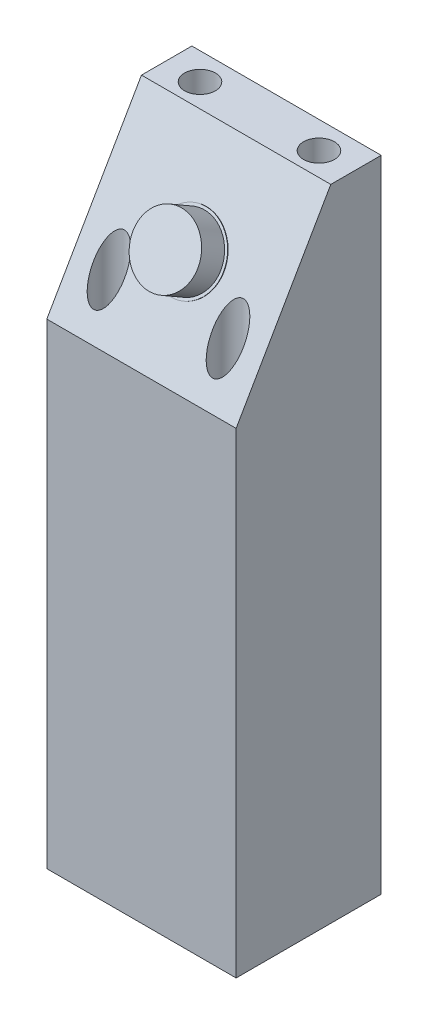
ISO-10303-21;
HEADER;
FILE_DESCRIPTION(('STEP AP214'),'2;1');
FILE_NAME('part.step','',(''),(''),'','','');
FILE_SCHEMA(('AUTOMOTIVE_DESIGN { 1 0 10303 214 1 1 1 1 }'));
ENDSEC;
DATA;
#1=APPLICATION_CONTEXT('core data for automotive mechanical design processes');
#2=APPLICATION_PROTOCOL_DEFINITION('international standard','automotive_design',2000,#1);
#3=PRODUCT_CONTEXT('',#1,'mechanical');
#4=PRODUCT('Part','Part','',(#3));
#5=PRODUCT_RELATED_PRODUCT_CATEGORY('part','',(#4));
#6=PRODUCT_DEFINITION_FORMATION('','',#4);
#7=PRODUCT_DEFINITION_CONTEXT('part definition',#1,'design');
#8=PRODUCT_DEFINITION('design','',#6,#7);
#9=PRODUCT_DEFINITION_SHAPE('','',#8);
#10=(LENGTH_UNIT() NAMED_UNIT(*) SI_UNIT(.MILLI.,.METRE.));
#11=(NAMED_UNIT(*) PLANE_ANGLE_UNIT() SI_UNIT($,.RADIAN.));
#12=(NAMED_UNIT(*) SI_UNIT($,.STERADIAN.) SOLID_ANGLE_UNIT());
#13=UNCERTAINTY_MEASURE_WITH_UNIT(LENGTH_MEASURE(1.E-05),#10,'distance_accuracy_value','');
#14=(GEOMETRIC_REPRESENTATION_CONTEXT(3) GLOBAL_UNCERTAINTY_ASSIGNED_CONTEXT((#13)) GLOBAL_UNIT_ASSIGNED_CONTEXT((#10,
#11,#12)) REPRESENTATION_CONTEXT('',''));
#15=CARTESIAN_POINT('',(0.,0.,0.));
#16=DIRECTION('',(0.,0.,1.));
#17=DIRECTION('',(1.,0.,0.));
#18=AXIS2_PLACEMENT_3D('',#15,#16,#17);
#19=CARTESIAN_POINT('',(28.5,4.5,-5.));
#20=DIRECTION('',(0.,-1.,0.));
#21=DIRECTION('',(0.,0.,-1.));
#22=AXIS2_PLACEMENT_3D('',#19,#20,#21);
#23=PLANE('',#22);
#24=CARTESIAN_POINT('',(28.5,4.5,-5.));
#25=DIRECTION('',(0.,-1.,0.));
#26=DIRECTION('',(0.,0.,-1.));
#27=AXIS2_PLACEMENT_3D('',#24,#25,#26);
#28=CIRCLE('',#27,2.85);
#29=CARTESIAN_POINT('',(28.5,4.5,-7.85));
#30=VERTEX_POINT('',#29);
#31=EDGE_CURVE('E133',#30,#30,#28,.T.);
#32=ORIENTED_EDGE('',*,*,#31,.F.);
#33=EDGE_LOOP('',(#32));
#34=FACE_BOUND('',#33,.T.);
#35=CARTESIAN_POINT('',(28.5,4.5,-5.));
#36=DIRECTION('',(0.,1.,0.));
#37=DIRECTION('',(0.,0.,1.));
#38=AXIS2_PLACEMENT_3D('',#35,#36,#37);
#39=CIRCLE('',#38,1.7);
#40=CARTESIAN_POINT('',(28.5,4.5,-3.3));
#41=VERTEX_POINT('',#40);
#42=EDGE_CURVE('E234',#41,#41,#39,.T.);
#43=ORIENTED_EDGE('',*,*,#42,.F.);
#44=EDGE_LOOP('',(#43));
#45=FACE_BOUND('',#44,.T.);
#46=ADVANCED_FACE('F35',(#34,#45),#23,.F.);
#47=CARTESIAN_POINT('',(35.,0.,0.));
#48=DIRECTION('',(0.,0.,-1.));
#49=DIRECTION('',(-1.,0.,0.));
#50=AXIS2_PLACEMENT_3D('',#47,#48,#49);
#51=PLANE('',#50);
#52=DIRECTION('',(0.,-1.,0.));
#53=VECTOR('',#52,1.);
#54=CARTESIAN_POINT('',(0.,0.,0.));
#55=LINE('',#54,#53);
#56=CARTESIAN_POINT('',(0.,88.,0.));
#57=VERTEX_POINT('',#56);
#58=CARTESIAN_POINT('',(0.,0.,0.));
#59=VERTEX_POINT('',#58);
#60=EDGE_CURVE('E114',#57,#59,#55,.T.);
#61=ORIENTED_EDGE('',*,*,#60,.T.);
#62=DIRECTION('',(-1.,0.,0.));
#63=VECTOR('',#62,1.);
#64=CARTESIAN_POINT('',(35.,0.,0.));
#65=LINE('',#64,#63);
#66=CARTESIAN_POINT('',(35.,0.,0.));
#67=VERTEX_POINT('',#66);
#68=EDGE_CURVE('E45',#67,#59,#65,.T.);
#69=ORIENTED_EDGE('',*,*,#68,.F.);
#70=DIRECTION('',(0.,-1.,0.));
#71=VECTOR('',#70,1.);
#72=CARTESIAN_POINT('',(35.,0.,0.));
#73=LINE('',#72,#71);
#74=CARTESIAN_POINT('',(35.,88.,0.));
#75=VERTEX_POINT('',#74);
#76=EDGE_CURVE('E123',#75,#67,#73,.T.);
#77=ORIENTED_EDGE('',*,*,#76,.F.);
#78=DIRECTION('',(-1.,0.,0.));
#79=VECTOR('',#78,1.);
#80=CARTESIAN_POINT('',(35.,88.,0.));
#81=LINE('',#80,#79);
#82=EDGE_CURVE('E110',#75,#57,#81,.T.);
#83=ORIENTED_EDGE('',*,*,#82,.T.);
#84=EDGE_LOOP('',(#61,#69,#77,#83));
#85=FACE_BOUND('',#84,.T.);
#86=ADVANCED_FACE('F37',(#85),#51,.F.);
#87=CARTESIAN_POINT('',(35.,0.,-17.4999999999999));
#88=DIRECTION('',(0.,1.,0.));
#89=DIRECTION('',(0.,0.,1.));
#90=AXIS2_PLACEMENT_3D('',#87,#88,#89);
#91=PLANE('',#90);
#92=CARTESIAN_POINT('',(6.49999999999999,0.,-5.));
#93=DIRECTION('',(0.,1.,0.));
#94=DIRECTION('',(0.,0.,1.));
#95=AXIS2_PLACEMENT_3D('',#92,#93,#94);
#96=CIRCLE('',#95,1.69999999999999);
#97=CARTESIAN_POINT('',(6.49999999999999,0.,-3.30000000000001));
#98=VERTEX_POINT('',#97);
#99=EDGE_CURVE('E221',#98,#98,#96,.T.);
#100=ORIENTED_EDGE('',*,*,#99,.T.);
#101=EDGE_LOOP('',(#100));
#102=FACE_BOUND('',#101,.T.);
#103=CARTESIAN_POINT('',(6.49999999999999,0.,-21.82));
#104=DIRECTION('',(0.,1.,0.));
#105=DIRECTION('',(0.,0.,1.));
#106=AXIS2_PLACEMENT_3D('',#103,#104,#105);
#107=CIRCLE('',#106,1.69999999999999);
#108=CARTESIAN_POINT('',(6.49999999999999,0.,-20.12));
#109=VERTEX_POINT('',#108);
#110=EDGE_CURVE('E225',#109,#109,#107,.T.);
#111=ORIENTED_EDGE('',*,*,#110,.T.);
#112=EDGE_LOOP('',(#111));
#113=FACE_BOUND('',#112,.T.);
#114=CARTESIAN_POINT('',(28.5,0.,-21.82));
#115=DIRECTION('',(0.,1.,0.));
#116=DIRECTION('',(0.,0.,1.));
#117=AXIS2_PLACEMENT_3D('',#114,#115,#116);
#118=CIRCLE('',#117,1.69999999999999);
#119=CARTESIAN_POINT('',(28.5,0.,-20.12));
#120=VERTEX_POINT('',#119);
#121=EDGE_CURVE('E229',#120,#120,#118,.T.);
#122=ORIENTED_EDGE('',*,*,#121,.T.);
#123=EDGE_LOOP('',(#122));
#124=FACE_BOUND('',#123,.T.);
#125=CARTESIAN_POINT('',(28.5,0.,-5.));
#126=DIRECTION('',(0.,1.,0.));
#127=DIRECTION('',(0.,0.,1.));
#128=AXIS2_PLACEMENT_3D('',#125,#126,#127);
#129=CIRCLE('',#128,1.69999999999999);
#130=CARTESIAN_POINT('',(28.5,0.,-3.30000000000001));
#131=VERTEX_POINT('',#130);
#132=EDGE_CURVE('E232',#131,#131,#129,.T.);
#133=ORIENTED_EDGE('',*,*,#132,.T.);
#134=EDGE_LOOP('',(#133));
#135=FACE_BOUND('',#134,.T.);
#136=DIRECTION('',(0.,0.,-1.));
#137=VECTOR('',#136,1.);
#138=CARTESIAN_POINT('',(0.,0.,-17.4999999999999));
#139=LINE('',#138,#137);
#140=CARTESIAN_POINT('',(0.,0.,-26.82));
#141=VERTEX_POINT('',#140);
#142=EDGE_CURVE('E117',#59,#141,#139,.T.);
#143=ORIENTED_EDGE('',*,*,#142,.T.);
#144=DIRECTION('',(-1.,0.,0.));
#145=VECTOR('',#144,1.);
#146=CARTESIAN_POINT('',(35.,0.,-26.82));
#147=LINE('',#146,#145);
#148=CARTESIAN_POINT('',(35.,0.,-26.82));
#149=VERTEX_POINT('',#148);
#150=EDGE_CURVE('E105',#149,#141,#147,.T.);
#151=ORIENTED_EDGE('',*,*,#150,.F.);
#152=DIRECTION('',(0.,0.,-1.));
#153=VECTOR('',#152,1.);
#154=CARTESIAN_POINT('',(35.,0.,0.));
#155=LINE('',#154,#153);
#156=EDGE_CURVE('E89',#67,#149,#155,.T.);
#157=ORIENTED_EDGE('',*,*,#156,.F.);
#158=ORIENTED_EDGE('',*,*,#68,.T.);
#159=EDGE_LOOP('',(#143,#151,#157,#158));
#160=FACE_BOUND('',#159,.T.);
#161=ADVANCED_FACE('F154',(#102,#113,#124,#135,#160),#91,.F.);
#162=CARTESIAN_POINT('',(35.,0.,-26.82));
#163=DIRECTION('',(0.,0.,1.));
#164=DIRECTION('',(1.,0.,0.));
#165=AXIS2_PLACEMENT_3D('',#162,#163,#164);
#166=PLANE('',#165);
#167=DIRECTION('',(0.,1.,0.));
#168=VECTOR('',#167,1.);
#169=CARTESIAN_POINT('',(0.,0.,-26.82));
#170=LINE('',#169,#168);
#171=CARTESIAN_POINT('',(0.,118.310889132455,-26.82));
#172=VERTEX_POINT('',#171);
#173=EDGE_CURVE('E104',#141,#172,#170,.T.);
#174=ORIENTED_EDGE('',*,*,#173,.T.);
#175=DIRECTION('',(-1.,0.,0.));
#176=VECTOR('',#175,1.);
#177=CARTESIAN_POINT('',(35.,118.310889132455,-26.82));
#178=LINE('',#177,#176);
#179=CARTESIAN_POINT('',(35.,118.310889132455,-26.82));
#180=VERTEX_POINT('',#179);
#181=EDGE_CURVE('E101',#180,#172,#178,.T.);
#182=ORIENTED_EDGE('',*,*,#181,.F.);
#183=DIRECTION('',(0.,1.,0.));
#184=VECTOR('',#183,1.);
#185=CARTESIAN_POINT('',(35.,0.,-26.82));
#186=LINE('',#185,#184);
#187=EDGE_CURVE('E93',#149,#180,#186,.T.);
#188=ORIENTED_EDGE('',*,*,#187,.F.);
#189=ORIENTED_EDGE('',*,*,#150,.T.);
#190=EDGE_LOOP('',(#174,#182,#188,#189));
#191=FACE_BOUND('',#190,.T.);
#192=ADVANCED_FACE('F102',(#191),#166,.F.);
#193=CARTESIAN_POINT('',(35.,118.310889132455,-26.82));
#194=DIRECTION('',(0.,-1.,0.));
#195=DIRECTION('',(0.,0.,-1.));
#196=AXIS2_PLACEMENT_3D('',#193,#194,#195);
#197=PLANE('',#196);
#198=CARTESIAN_POINT('',(6.49999999999999,118.310889132455,-21.82));
#199=DIRECTION('',(0.,-1.,0.));
#200=DIRECTION('',(0.,0.,-1.));
#201=AXIS2_PLACEMENT_3D('',#198,#199,#200);
#202=CIRCLE('',#201,2.85);
#203=CARTESIAN_POINT('',(6.49999999999999,118.310889132455,-24.67));
#204=VERTEX_POINT('',#203);
#205=EDGE_CURVE('E244',#204,#204,#202,.T.);
#206=ORIENTED_EDGE('',*,*,#205,.T.);
#207=EDGE_LOOP('',(#206));
#208=FACE_BOUND('',#207,.T.);
#209=CARTESIAN_POINT('',(28.5,118.310889132455,-21.82));
#210=DIRECTION('',(0.,-1.,0.));
#211=DIRECTION('',(0.,0.,1.));
#212=AXIS2_PLACEMENT_3D('',#209,#210,#211);
#213=CIRCLE('',#212,2.85);
#214=CARTESIAN_POINT('',(28.5,118.310889132455,-18.97));
#215=VERTEX_POINT('',#214);
#216=EDGE_CURVE('E237',#215,#215,#213,.T.);
#217=ORIENTED_EDGE('',*,*,#216,.T.);
#218=EDGE_LOOP('',(#217));
#219=FACE_BOUND('',#218,.T.);
#220=DIRECTION('',(0.,0.,1.));
#221=VECTOR('',#220,1.);
#222=CARTESIAN_POINT('',(0.,118.310889132455,-26.82));
#223=LINE('',#222,#221);
#224=CARTESIAN_POINT('',(0.,118.310889132455,-17.4999999999999));
#225=VERTEX_POINT('',#224);
#226=EDGE_CURVE('E74',#172,#225,#223,.T.);
#227=ORIENTED_EDGE('',*,*,#226,.T.);
#228=DIRECTION('',(-1.,0.,0.));
#229=VECTOR('',#228,1.);
#230=CARTESIAN_POINT('',(35.,118.310889132455,-17.4999999999999));
#231=LINE('',#230,#229);
#232=CARTESIAN_POINT('',(35.,118.310889132455,-17.4999999999999));
#233=VERTEX_POINT('',#232);
#234=EDGE_CURVE('E106',#233,#225,#231,.T.);
#235=ORIENTED_EDGE('',*,*,#234,.F.);
#236=DIRECTION('',(0.,0.,1.));
#237=VECTOR('',#236,1.);
#238=CARTESIAN_POINT('',(35.,118.310889132455,-26.82));
#239=LINE('',#238,#237);
#240=EDGE_CURVE('E97',#180,#233,#239,.T.);
#241=ORIENTED_EDGE('',*,*,#240,.F.);
#242=ORIENTED_EDGE('',*,*,#181,.T.);
#243=EDGE_LOOP('',(#227,#235,#241,#242));
#244=FACE_BOUND('',#243,.T.);
#245=ADVANCED_FACE('F108',(#208,#219,#244),#197,.F.);
#246=CARTESIAN_POINT('',(35.,88.,0.));
#247=DIRECTION('',(0.,-0.499999999999998,-0.86602540378444));
#248=DIRECTION('',(0.,0.86602540378444,-0.499999999999998));
#249=AXIS2_PLACEMENT_3D('',#246,#247,#248);
#250=PLANE('',#249);
#251=CARTESIAN_POINT('',(6.49999999999999,96.6602540378445,-5.));
#252=DIRECTION('',(0.,-0.499999999999998,-0.86602540378444));
#253=DIRECTION('',(0.,-0.86602540378444,0.499999999999998));
#254=AXIS2_PLACEMENT_3D('',#251,#252,#253);
#255=ELLIPSE('',#254,5.70000000000003,2.85);
#256=CARTESIAN_POINT('',(6.49999999999999,91.7239092362731,-2.15));
#257=VERTEX_POINT('',#256);
#258=EDGE_CURVE('E39',#257,#257,#255,.T.);
#259=ORIENTED_EDGE('',*,*,#258,.T.);
#260=EDGE_LOOP('',(#259));
#261=FACE_BOUND('',#260,.T.);
#262=CARTESIAN_POINT('',(28.5,96.6602540378445,-5.));
#263=DIRECTION('',(0.,-0.499999999999998,-0.86602540378444));
#264=DIRECTION('',(0.,-0.86602540378444,0.499999999999998));
#265=AXIS2_PLACEMENT_3D('',#262,#263,#264);
#266=ELLIPSE('',#265,5.70000000000003,2.85);
#267=CARTESIAN_POINT('',(28.5,91.7239092362731,-2.15));
#268=VERTEX_POINT('',#267);
#269=EDGE_CURVE('E131',#268,#268,#266,.T.);
#270=ORIENTED_EDGE('',*,*,#269,.T.);
#271=EDGE_LOOP('',(#270));
#272=FACE_BOUND('',#271,.T.);
#273=CARTESIAN_POINT('',(17.5,103.155444566228,-8.74999999999998));
#274=DIRECTION('',(0.,-0.499999999999998,-0.86602540378444));
#275=DIRECTION('',(0.,0.86602540378444,-0.499999999999998));
#276=AXIS2_PLACEMENT_3D('',#273,#274,#275);
#277=CIRCLE('',#276,6.50000000000001);
#278=CARTESIAN_POINT('',(17.5,108.784609690827,-12.));
#279=VERTEX_POINT('',#278);
#280=EDGE_CURVE('E11',#279,#279,#277,.F.);
#281=ORIENTED_EDGE('',*,*,#280,.F.);
#282=EDGE_LOOP('',(#281));
#283=FACE_BOUND('',#282,.T.);
#284=DIRECTION('',(0.,-0.86602540378444,0.499999999999998));
#285=VECTOR('',#284,1.);
#286=CARTESIAN_POINT('',(0.,88.,0.));
#287=LINE('',#286,#285);
#288=EDGE_CURVE('E80',#225,#57,#287,.T.);
#289=ORIENTED_EDGE('',*,*,#288,.T.);
#290=ORIENTED_EDGE('',*,*,#82,.F.);
#291=DIRECTION('',(0.,-0.86602540378444,0.499999999999998));
#292=VECTOR('',#291,1.);
#293=CARTESIAN_POINT('',(35.,88.,0.));
#294=LINE('',#293,#292);
#295=EDGE_CURVE('E54',#233,#75,#294,.T.);
#296=ORIENTED_EDGE('',*,*,#295,.F.);
#297=ORIENTED_EDGE('',*,*,#234,.T.);
#298=EDGE_LOOP('',(#289,#290,#296,#297));
#299=FACE_BOUND('',#298,.T.);
#300=ADVANCED_FACE('F167',(#261,#272,#283,#299),#250,.F.);
#301=CARTESIAN_POINT('',(35.,0.,0.));
#302=DIRECTION('',(1.,0.,0.));
#303=DIRECTION('',(0.,0.,-1.));
#304=AXIS2_PLACEMENT_3D('',#301,#302,#303);
#305=PLANE('',#304);
#306=ORIENTED_EDGE('',*,*,#76,.T.);
#307=ORIENTED_EDGE('',*,*,#156,.T.);
#308=ORIENTED_EDGE('',*,*,#187,.T.);
#309=ORIENTED_EDGE('',*,*,#240,.T.);
#310=ORIENTED_EDGE('',*,*,#295,.T.);
#311=EDGE_LOOP('',(#306,#307,#308,#309,#310));
#312=FACE_BOUND('',#311,.T.);
#313=ADVANCED_FACE('F95',(#312),#305,.T.);
#314=CARTESIAN_POINT('',(0.,0.,0.));
#315=DIRECTION('',(1.,0.,0.));
#316=DIRECTION('',(0.,0.,-1.));
#317=AXIS2_PLACEMENT_3D('',#314,#315,#316);
#318=PLANE('',#317);
#319=ORIENTED_EDGE('',*,*,#60,.F.);
#320=ORIENTED_EDGE('',*,*,#288,.F.);
#321=ORIENTED_EDGE('',*,*,#226,.F.);
#322=ORIENTED_EDGE('',*,*,#173,.F.);
#323=ORIENTED_EDGE('',*,*,#142,.F.);
#324=EDGE_LOOP('',(#319,#320,#321,#322,#323));
#325=FACE_BOUND('',#324,.T.);
#326=ADVANCED_FACE('F156',(#325),#318,.F.);
#327=CARTESIAN_POINT('',(17.5,103.205444566228,-8.66339745962154));
#328=DIRECTION('',(0.,-0.499999999999998,-0.86602540378444));
#329=DIRECTION('',(0.,0.86602540378444,-0.499999999999998));
#330=AXIS2_PLACEMENT_3D('',#327,#328,#329);
#331=CYLINDRICAL_SURFACE('',#330,6.50000000000001);
#332=CARTESIAN_POINT('',(17.5,103.205444566228,-8.66339745962154));
#333=DIRECTION('',(0.,0.499999999999998,0.86602540378444));
#334=DIRECTION('',(0.,-0.86602540378444,0.499999999999998));
#335=AXIS2_PLACEMENT_3D('',#332,#333,#334);
#336=CIRCLE('',#335,6.50000000000001);
#337=CARTESIAN_POINT('',(17.5,97.5762794416289,-5.41339745962155));
#338=VERTEX_POINT('',#337);
#339=EDGE_CURVE('E130',#338,#338,#336,.T.);
#340=ORIENTED_EDGE('',*,*,#339,.F.);
#341=EDGE_LOOP('',(#340));
#342=FACE_BOUND('',#341,.T.);
#343=ORIENTED_EDGE('',*,*,#280,.T.);
#344=EDGE_LOOP('',(#343));
#345=FACE_BOUND('',#344,.T.);
#346=ADVANCED_FACE('F158',(#342,#345),#331,.T.);
#347=CARTESIAN_POINT('',(17.5,103.205444566228,-8.66339745962154));
#348=DIRECTION('',(0.,0.499999999999998,0.86602540378444));
#349=DIRECTION('',(0.,-0.86602540378444,0.499999999999998));
#350=AXIS2_PLACEMENT_3D('',#347,#348,#349);
#351=PLANE('',#350);
#352=CARTESIAN_POINT('',(17.5,103.205444566228,-8.66339745962154));
#353=DIRECTION('',(0.,0.499999999999998,0.86602540378444));
#354=DIRECTION('',(0.,-0.86602540378444,0.499999999999998));
#355=AXIS2_PLACEMENT_3D('',#352,#353,#354);
#356=CIRCLE('',#355,6.00000000000001);
#357=CARTESIAN_POINT('',(17.5,98.0092921435211,-5.66339745962155));
#358=VERTEX_POINT('',#357);
#359=EDGE_CURVE('E128',#358,#358,#356,.T.);
#360=ORIENTED_EDGE('',*,*,#359,.F.);
#361=EDGE_LOOP('',(#360));
#362=FACE_BOUND('',#361,.T.);
#363=ORIENTED_EDGE('',*,*,#339,.T.);
#364=EDGE_LOOP('',(#363));
#365=FACE_BOUND('',#364,.T.);
#366=ADVANCED_FACE('F164',(#362,#365),#351,.T.);
#367=CARTESIAN_POINT('',(17.5,105.655444566228,-4.41987298107775));
#368=DIRECTION('',(0.,0.499999999999998,0.86602540378444));
#369=DIRECTION('',(0.,-0.86602540378444,0.499999999999998));
#370=AXIS2_PLACEMENT_3D('',#367,#368,#369);
#371=PLANE('',#370);
#372=CARTESIAN_POINT('',(17.5,105.655444566228,-4.41987298107775));
#373=DIRECTION('',(0.,0.499999999999998,0.86602540378444));
#374=DIRECTION('',(0.,-0.86602540378444,0.499999999999998));
#375=AXIS2_PLACEMENT_3D('',#372,#373,#374);
#376=CIRCLE('',#375,6.00000000000001);
#377=CARTESIAN_POINT('',(17.5,100.459292143521,-1.41987298107776));
#378=VERTEX_POINT('',#377);
#379=EDGE_CURVE('E118',#378,#378,#376,.T.);
#380=ORIENTED_EDGE('',*,*,#379,.T.);
#381=EDGE_LOOP('',(#380));
#382=FACE_BOUND('',#381,.T.);
#383=ADVANCED_FACE('F187',(#382),#371,.T.);
#384=CARTESIAN_POINT('',(17.5,105.655444566228,-4.41987298107775));
#385=DIRECTION('',(0.,-0.499999999999998,-0.86602540378444));
#386=DIRECTION('',(0.,0.86602540378444,-0.499999999999998));
#387=AXIS2_PLACEMENT_3D('',#384,#385,#386);
#388=CYLINDRICAL_SURFACE('',#387,6.00000000000001);
#389=ORIENTED_EDGE('',*,*,#359,.T.);
#390=EDGE_LOOP('',(#389));
#391=FACE_BOUND('',#390,.T.);
#392=ORIENTED_EDGE('',*,*,#379,.F.);
#393=EDGE_LOOP('',(#392));
#394=FACE_BOUND('',#393,.T.);
#395=ADVANCED_FACE('F185',(#391,#394),#388,.T.);
#396=CARTESIAN_POINT('',(28.5,118.310889132455,-5.));
#397=DIRECTION('',(0.,-1.,0.));
#398=DIRECTION('',(0.,0.,-1.));
#399=AXIS2_PLACEMENT_3D('',#396,#397,#398);
#400=CYLINDRICAL_SURFACE('',#399,2.85);
#401=ORIENTED_EDGE('',*,*,#31,.T.);
#402=EDGE_LOOP('',(#401));
#403=FACE_BOUND('',#402,.T.);
#404=ORIENTED_EDGE('',*,*,#269,.F.);
#405=EDGE_LOOP('',(#404));
#406=FACE_BOUND('',#405,.T.);
#407=ADVANCED_FACE('F181',(#403,#406),#400,.F.);
#408=CARTESIAN_POINT('',(6.49999999999999,118.310889132455,-5.));
#409=DIRECTION('',(0.,-1.,0.));
#410=DIRECTION('',(0.,0.,-1.));
#411=AXIS2_PLACEMENT_3D('',#408,#409,#410);
#412=CYLINDRICAL_SURFACE('',#411,2.85);
#413=CARTESIAN_POINT('',(6.49999999999999,4.5,-5.));
#414=DIRECTION('',(0.,-1.,0.));
#415=DIRECTION('',(0.,0.,1.));
#416=AXIS2_PLACEMENT_3D('',#413,#414,#415);
#417=CIRCLE('',#416,2.85);
#418=CARTESIAN_POINT('',(6.49999999999999,4.5,-2.15));
#419=VERTEX_POINT('',#418);
#420=EDGE_CURVE('E143',#419,#419,#417,.T.);
#421=ORIENTED_EDGE('',*,*,#420,.T.);
#422=EDGE_LOOP('',(#421));
#423=FACE_BOUND('',#422,.T.);
#424=ORIENTED_EDGE('',*,*,#258,.F.);
#425=EDGE_LOOP('',(#424));
#426=FACE_BOUND('',#425,.T.);
#427=ADVANCED_FACE('F184',(#423,#426),#412,.F.);
#428=CARTESIAN_POINT('',(6.49999999999999,4.5,-5.));
#429=DIRECTION('',(0.,1.,0.));
#430=DIRECTION('',(0.,0.,1.));
#431=AXIS2_PLACEMENT_3D('',#428,#429,#430);
#432=PLANE('',#431);
#433=CARTESIAN_POINT('',(6.49999999999999,4.5,-5.));
#434=DIRECTION('',(0.,1.,0.));
#435=DIRECTION('',(0.,0.,1.));
#436=AXIS2_PLACEMENT_3D('',#433,#434,#435);
#437=CIRCLE('',#436,1.7);
#438=CARTESIAN_POINT('',(6.49999999999999,4.5,-3.30000000000001));
#439=VERTEX_POINT('',#438);
#440=EDGE_CURVE('E298',#439,#439,#437,.T.);
#441=ORIENTED_EDGE('',*,*,#440,.F.);
#442=EDGE_LOOP('',(#441));
#443=FACE_BOUND('',#442,.T.);
#444=ORIENTED_EDGE('',*,*,#420,.F.);
#445=EDGE_LOOP('',(#444));
#446=FACE_BOUND('',#445,.T.);
#447=ADVANCED_FACE('F256',(#443,#446),#432,.T.);
#448=CARTESIAN_POINT('',(28.5,118.310889132455,-21.82));
#449=DIRECTION('',(0.,-1.,0.));
#450=DIRECTION('',(0.,0.,-1.));
#451=AXIS2_PLACEMENT_3D('',#448,#449,#450);
#452=CYLINDRICAL_SURFACE('',#451,2.85);
#453=ORIENTED_EDGE('',*,*,#216,.F.);
#454=EDGE_LOOP('',(#453));
#455=FACE_BOUND('',#454,.T.);
#456=CARTESIAN_POINT('',(28.5,4.5,-21.82));
#457=DIRECTION('',(0.,-1.,0.));
#458=DIRECTION('',(0.,0.,1.));
#459=AXIS2_PLACEMENT_3D('',#456,#457,#458);
#460=CIRCLE('',#459,2.85);
#461=CARTESIAN_POINT('',(28.5,4.5,-18.97));
#462=VERTEX_POINT('',#461);
#463=EDGE_CURVE('E145',#462,#462,#460,.T.);
#464=ORIENTED_EDGE('',*,*,#463,.T.);
#465=EDGE_LOOP('',(#464));
#466=FACE_BOUND('',#465,.T.);
#467=ADVANCED_FACE('F179',(#455,#466),#452,.F.);
#468=CARTESIAN_POINT('',(28.5,4.5,-21.82));
#469=DIRECTION('',(0.,1.,0.));
#470=DIRECTION('',(0.,0.,1.));
#471=AXIS2_PLACEMENT_3D('',#468,#469,#470);
#472=PLANE('',#471);
#473=CARTESIAN_POINT('',(28.5,4.5,-21.82));
#474=DIRECTION('',(0.,1.,0.));
#475=DIRECTION('',(0.,0.,1.));
#476=AXIS2_PLACEMENT_3D('',#473,#474,#475);
#477=CIRCLE('',#476,1.7);
#478=CARTESIAN_POINT('',(28.5,4.5,-20.12));
#479=VERTEX_POINT('',#478);
#480=EDGE_CURVE('E306',#479,#479,#477,.T.);
#481=ORIENTED_EDGE('',*,*,#480,.F.);
#482=EDGE_LOOP('',(#481));
#483=FACE_BOUND('',#482,.T.);
#484=ORIENTED_EDGE('',*,*,#463,.F.);
#485=EDGE_LOOP('',(#484));
#486=FACE_BOUND('',#485,.T.);
#487=ADVANCED_FACE('F255',(#483,#486),#472,.T.);
#488=CARTESIAN_POINT('',(6.49999999999999,118.310889132455,-21.82));
#489=DIRECTION('',(0.,-1.,0.));
#490=DIRECTION('',(0.,0.,-1.));
#491=AXIS2_PLACEMENT_3D('',#488,#489,#490);
#492=CYLINDRICAL_SURFACE('',#491,2.85);
#493=ORIENTED_EDGE('',*,*,#205,.F.);
#494=EDGE_LOOP('',(#493));
#495=FACE_BOUND('',#494,.T.);
#496=CARTESIAN_POINT('',(6.49999999999999,4.5,-21.82));
#497=DIRECTION('',(0.,-1.,0.));
#498=DIRECTION('',(0.,0.,-1.));
#499=AXIS2_PLACEMENT_3D('',#496,#497,#498);
#500=CIRCLE('',#499,2.85);
#501=CARTESIAN_POINT('',(6.49999999999999,4.5,-24.67));
#502=VERTEX_POINT('',#501);
#503=EDGE_CURVE('E247',#502,#502,#500,.T.);
#504=ORIENTED_EDGE('',*,*,#503,.T.);
#505=EDGE_LOOP('',(#504));
#506=FACE_BOUND('',#505,.T.);
#507=ADVANCED_FACE('F260',(#495,#506),#492,.F.);
#508=CARTESIAN_POINT('',(6.49999999999999,4.5,-21.82));
#509=DIRECTION('',(0.,-1.,0.));
#510=DIRECTION('',(0.,0.,-1.));
#511=AXIS2_PLACEMENT_3D('',#508,#509,#510);
#512=PLANE('',#511);
#513=CARTESIAN_POINT('',(6.49999999999999,4.5,-21.82));
#514=DIRECTION('',(0.,1.,0.));
#515=DIRECTION('',(0.,0.,1.));
#516=AXIS2_PLACEMENT_3D('',#513,#514,#515);
#517=CIRCLE('',#516,1.7);
#518=CARTESIAN_POINT('',(6.49999999999999,4.5,-20.12));
#519=VERTEX_POINT('',#518);
#520=EDGE_CURVE('E300',#519,#519,#517,.T.);
#521=ORIENTED_EDGE('',*,*,#520,.F.);
#522=EDGE_LOOP('',(#521));
#523=FACE_BOUND('',#522,.T.);
#524=ORIENTED_EDGE('',*,*,#503,.F.);
#525=EDGE_LOOP('',(#524));
#526=FACE_BOUND('',#525,.T.);
#527=ADVANCED_FACE('F265',(#523,#526),#512,.F.);
#528=CARTESIAN_POINT('',(28.5,4.5,-5.));
#529=DIRECTION('',(0.,1.,0.));
#530=DIRECTION('',(0.,0.,1.));
#531=AXIS2_PLACEMENT_3D('',#528,#529,#530);
#532=CYLINDRICAL_SURFACE('',#531,1.69999999999999);
#533=ORIENTED_EDGE('',*,*,#132,.F.);
#534=EDGE_LOOP('',(#533));
#535=FACE_BOUND('',#534,.T.);
#536=ORIENTED_EDGE('',*,*,#42,.T.);
#537=EDGE_LOOP('',(#536));
#538=FACE_BOUND('',#537,.T.);
#539=ADVANCED_FACE('F272',(#535,#538),#532,.F.);
#540=CARTESIAN_POINT('',(28.5,4.5,-21.82));
#541=DIRECTION('',(0.,1.,0.));
#542=DIRECTION('',(0.,0.,1.));
#543=AXIS2_PLACEMENT_3D('',#540,#541,#542);
#544=CYLINDRICAL_SURFACE('',#543,1.69999999999999);
#545=ORIENTED_EDGE('',*,*,#121,.F.);
#546=EDGE_LOOP('',(#545));
#547=FACE_BOUND('',#546,.T.);
#548=ORIENTED_EDGE('',*,*,#480,.T.);
#549=EDGE_LOOP('',(#548));
#550=FACE_BOUND('',#549,.T.);
#551=ADVANCED_FACE('F282',(#547,#550),#544,.F.);
#552=CARTESIAN_POINT('',(6.49999999999999,4.5,-21.82));
#553=DIRECTION('',(0.,1.,0.));
#554=DIRECTION('',(0.,0.,1.));
#555=AXIS2_PLACEMENT_3D('',#552,#553,#554);
#556=CYLINDRICAL_SURFACE('',#555,1.69999999999999);
#557=ORIENTED_EDGE('',*,*,#110,.F.);
#558=EDGE_LOOP('',(#557));
#559=FACE_BOUND('',#558,.T.);
#560=ORIENTED_EDGE('',*,*,#520,.T.);
#561=EDGE_LOOP('',(#560));
#562=FACE_BOUND('',#561,.T.);
#563=ADVANCED_FACE('F285',(#559,#562),#556,.F.);
#564=CARTESIAN_POINT('',(6.49999999999999,4.5,-5.));
#565=DIRECTION('',(0.,1.,0.));
#566=DIRECTION('',(0.,0.,1.));
#567=AXIS2_PLACEMENT_3D('',#564,#565,#566);
#568=CYLINDRICAL_SURFACE('',#567,1.69999999999999);
#569=ORIENTED_EDGE('',*,*,#99,.F.);
#570=EDGE_LOOP('',(#569));
#571=FACE_BOUND('',#570,.T.);
#572=ORIENTED_EDGE('',*,*,#440,.T.);
#573=EDGE_LOOP('',(#572));
#574=FACE_BOUND('',#573,.T.);
#575=ADVANCED_FACE('F289',(#571,#574),#568,.F.);
#576=CLOSED_SHELL('',(#46,#86,#161,#192,#245,#300,#313,#326,#346,#366,#383,#395,#407,#427,#447,
#467,#487,#507,#527,#539,#551,#563,#575));
#577=MANIFOLD_SOLID_BREP('B2',#576);
#578=ADVANCED_BREP_SHAPE_REPRESENTATION('',(#18,#577),#14);
#579=SHAPE_DEFINITION_REPRESENTATION(#9,#578);
ENDSEC;
END-ISO-10303-21;
